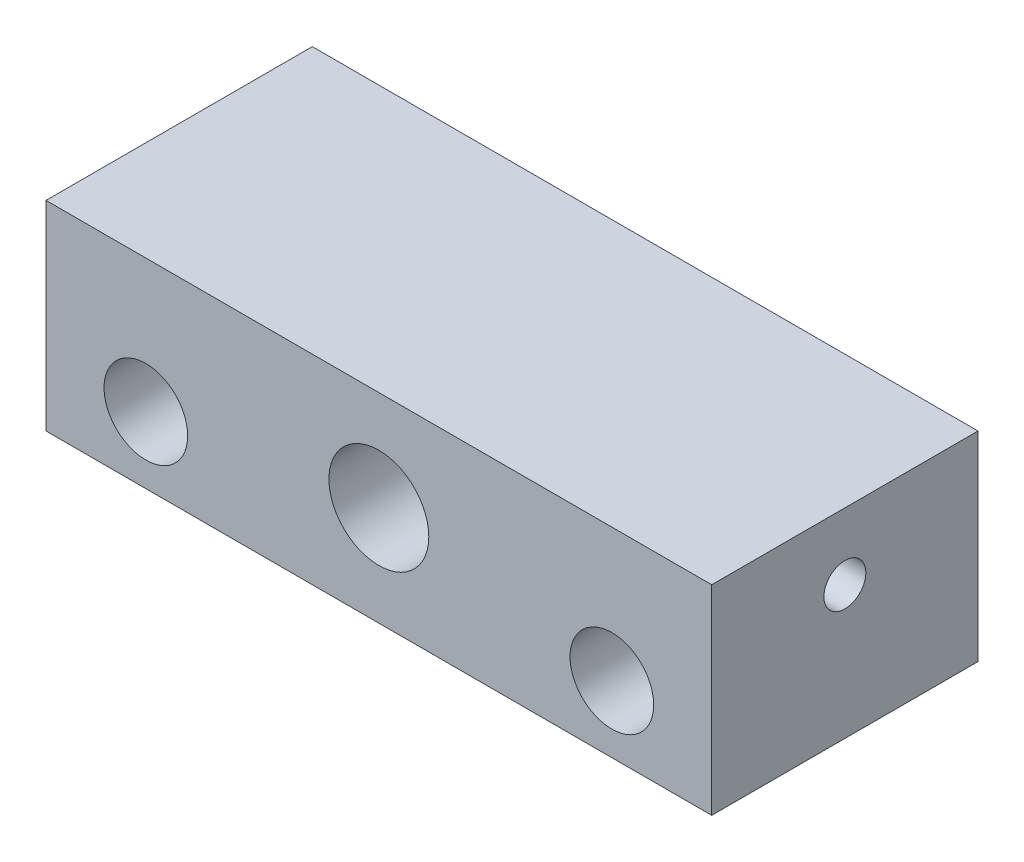
ISO-10303-21;
HEADER;
FILE_DESCRIPTION(('STEP AP214'),'2;1');
FILE_NAME('part.step','',(''),(''),'','','');
FILE_SCHEMA(('AUTOMOTIVE_DESIGN { 1 0 10303 214 1 1 1 1 }'));
ENDSEC;
DATA;
#1=APPLICATION_CONTEXT('core data for automotive mechanical design processes');
#2=APPLICATION_PROTOCOL_DEFINITION('international standard','automotive_design',2000,#1);
#3=PRODUCT_CONTEXT('',#1,'mechanical');
#4=PRODUCT('Part','Part','',(#3));
#5=PRODUCT_RELATED_PRODUCT_CATEGORY('part','',(#4));
#6=PRODUCT_DEFINITION_FORMATION('','',#4);
#7=PRODUCT_DEFINITION_CONTEXT('part definition',#1,'design');
#8=PRODUCT_DEFINITION('design','',#6,#7);
#9=PRODUCT_DEFINITION_SHAPE('','',#8);
#10=(LENGTH_UNIT() NAMED_UNIT(*) SI_UNIT(.MILLI.,.METRE.));
#11=(NAMED_UNIT(*) PLANE_ANGLE_UNIT() SI_UNIT($,.RADIAN.));
#12=(NAMED_UNIT(*) SI_UNIT($,.STERADIAN.) SOLID_ANGLE_UNIT());
#13=UNCERTAINTY_MEASURE_WITH_UNIT(LENGTH_MEASURE(1.E-05),#10,'distance_accuracy_value','');
#14=(GEOMETRIC_REPRESENTATION_CONTEXT(3) GLOBAL_UNCERTAINTY_ASSIGNED_CONTEXT((#13)) GLOBAL_UNIT_ASSIGNED_CONTEXT((#10,
#11,#12)) REPRESENTATION_CONTEXT('',''));
#15=CARTESIAN_POINT('',(0.,0.,0.));
#16=DIRECTION('',(0.,0.,1.));
#17=DIRECTION('',(1.,0.,0.));
#18=AXIS2_PLACEMENT_3D('',#15,#16,#17);
#19=CARTESIAN_POINT('',(31.75,9.525,-25.4));
#20=DIRECTION('',(1.,0.,0.));
#21=DIRECTION('',(0.,1.,0.));
#22=AXIS2_PLACEMENT_3D('',#19,#20,#21);
#23=PLANE('',#22);
#24=CARTESIAN_POINT('',(31.75,3.17500000000001,-12.7));
#25=DIRECTION('',(-1.,0.,0.));
#26=DIRECTION('',(0.,0.,1.));
#27=AXIS2_PLACEMENT_3D('',#24,#25,#26);
#28=CIRCLE('',#27,2.);
#29=CARTESIAN_POINT('',(31.75,3.17500000000001,-10.7));
#30=VERTEX_POINT('',#29);
#31=EDGE_CURVE('E169',#30,#30,#28,.T.);
#32=ORIENTED_EDGE('',*,*,#31,.T.);
#33=EDGE_LOOP('',(#32));
#34=FACE_BOUND('',#33,.T.);
#35=DIRECTION('',(0.,1.,0.));
#36=VECTOR('',#35,1.);
#37=CARTESIAN_POINT('',(31.75,9.525,0.));
#38=LINE('',#37,#36);
#39=CARTESIAN_POINT('',(31.75,-9.525,0.));
#40=VERTEX_POINT('',#39);
#41=CARTESIAN_POINT('',(31.75,9.525,0.));
#42=VERTEX_POINT('',#41);
#43=EDGE_CURVE('E101',#40,#42,#38,.T.);
#44=ORIENTED_EDGE('',*,*,#43,.F.);
#45=DIRECTION('',(0.,0.,1.));
#46=VECTOR('',#45,1.);
#47=CARTESIAN_POINT('',(31.75,-9.525,-25.4));
#48=LINE('',#47,#46);
#49=CARTESIAN_POINT('',(31.75,-9.525,-25.4));
#50=VERTEX_POINT('',#49);
#51=EDGE_CURVE('E11',#50,#40,#48,.T.);
#52=ORIENTED_EDGE('',*,*,#51,.F.);
#53=DIRECTION('',(0.,1.,0.));
#54=VECTOR('',#53,1.);
#55=CARTESIAN_POINT('',(31.75,9.525,-25.4));
#56=LINE('',#55,#54);
#57=CARTESIAN_POINT('',(31.75,9.525,-25.4));
#58=VERTEX_POINT('',#57);
#59=EDGE_CURVE('E94',#50,#58,#56,.T.);
#60=ORIENTED_EDGE('',*,*,#59,.T.);
#61=DIRECTION('',(0.,0.,1.));
#62=VECTOR('',#61,1.);
#63=CARTESIAN_POINT('',(31.75,9.525,-25.4));
#64=LINE('',#63,#62);
#65=EDGE_CURVE('E39',#58,#42,#64,.T.);
#66=ORIENTED_EDGE('',*,*,#65,.T.);
#67=EDGE_LOOP('',(#44,#52,#60,#66));
#68=FACE_BOUND('',#67,.T.);
#69=ADVANCED_FACE('F36',(#34,#68),#23,.T.);
#70=CARTESIAN_POINT('',(-31.75,-9.52500000000001,-25.4));
#71=DIRECTION('',(0.,-1.,0.));
#72=DIRECTION('',(1.,0.,0.));
#73=AXIS2_PLACEMENT_3D('',#70,#71,#72);
#74=PLANE('',#73);
#75=DIRECTION('',(1.,0.,0.));
#76=VECTOR('',#75,1.);
#77=CARTESIAN_POINT('',(-31.75,-9.52500000000001,0.));
#78=LINE('',#77,#76);
#79=CARTESIAN_POINT('',(-31.75,-9.52500000000001,0.));
#80=VERTEX_POINT('',#79);
#81=EDGE_CURVE('E96',#80,#40,#78,.T.);
#82=ORIENTED_EDGE('',*,*,#81,.F.);
#83=DIRECTION('',(0.,0.,1.));
#84=VECTOR('',#83,1.);
#85=CARTESIAN_POINT('',(-31.75,-9.52500000000001,-25.4));
#86=LINE('',#85,#84);
#87=CARTESIAN_POINT('',(-31.75,-9.52500000000001,-25.4));
#88=VERTEX_POINT('',#87);
#89=EDGE_CURVE('E45',#88,#80,#86,.T.);
#90=ORIENTED_EDGE('',*,*,#89,.F.);
#91=DIRECTION('',(1.,0.,0.));
#92=VECTOR('',#91,1.);
#93=CARTESIAN_POINT('',(-31.75,-9.52500000000001,-25.4));
#94=LINE('',#93,#92);
#95=EDGE_CURVE('E91',#88,#50,#94,.T.);
#96=ORIENTED_EDGE('',*,*,#95,.T.);
#97=ORIENTED_EDGE('',*,*,#51,.T.);
#98=EDGE_LOOP('',(#82,#90,#96,#97));
#99=FACE_BOUND('',#98,.T.);
#100=ADVANCED_FACE('F112',(#99),#74,.T.);
#101=CARTESIAN_POINT('',(-31.75,9.52499999999999,-25.4));
#102=DIRECTION('',(-1.,0.,0.));
#103=DIRECTION('',(0.,-1.,0.));
#104=AXIS2_PLACEMENT_3D('',#101,#102,#103);
#105=PLANE('',#104);
#106=CARTESIAN_POINT('',(-31.75,3.175,-12.7));
#107=DIRECTION('',(-1.,0.,0.));
#108=DIRECTION('',(0.,0.,1.));
#109=AXIS2_PLACEMENT_3D('',#106,#107,#108);
#110=CIRCLE('',#109,2.);
#111=CARTESIAN_POINT('',(-31.75,3.175,-10.7));
#112=VERTEX_POINT('',#111);
#113=EDGE_CURVE('E168',#112,#112,#110,.T.);
#114=ORIENTED_EDGE('',*,*,#113,.F.);
#115=EDGE_LOOP('',(#114));
#116=FACE_BOUND('',#115,.T.);
#117=DIRECTION('',(0.,-1.,0.));
#118=VECTOR('',#117,1.);
#119=CARTESIAN_POINT('',(-31.75,9.52499999999999,0.));
#120=LINE('',#119,#118);
#121=CARTESIAN_POINT('',(-31.75,9.52499999999999,0.));
#122=VERTEX_POINT('',#121);
#123=EDGE_CURVE('E86',#122,#80,#120,.T.);
#124=ORIENTED_EDGE('',*,*,#123,.F.);
#125=DIRECTION('',(0.,0.,1.));
#126=VECTOR('',#125,1.);
#127=CARTESIAN_POINT('',(-31.75,9.52499999999999,-25.4));
#128=LINE('',#127,#126);
#129=CARTESIAN_POINT('',(-31.75,9.52499999999999,-25.4));
#130=VERTEX_POINT('',#129);
#131=EDGE_CURVE('E81',#130,#122,#128,.T.);
#132=ORIENTED_EDGE('',*,*,#131,.F.);
#133=DIRECTION('',(0.,-1.,0.));
#134=VECTOR('',#133,1.);
#135=CARTESIAN_POINT('',(-31.75,9.52499999999999,-25.4));
#136=LINE('',#135,#134);
#137=EDGE_CURVE('E84',#130,#88,#136,.T.);
#138=ORIENTED_EDGE('',*,*,#137,.T.);
#139=ORIENTED_EDGE('',*,*,#89,.T.);
#140=EDGE_LOOP('',(#124,#132,#138,#139));
#141=FACE_BOUND('',#140,.T.);
#142=ADVANCED_FACE('F83',(#116,#141),#105,.T.);
#143=CARTESIAN_POINT('',(-31.75,9.52499999999999,-25.4));
#144=DIRECTION('',(0.,1.,0.));
#145=DIRECTION('',(-1.,0.,0.));
#146=AXIS2_PLACEMENT_3D('',#143,#144,#145);
#147=PLANE('',#146);
#148=DIRECTION('',(-1.,0.,0.));
#149=VECTOR('',#148,1.);
#150=CARTESIAN_POINT('',(-31.75,9.52499999999999,0.));
#151=LINE('',#150,#149);
#152=EDGE_CURVE('E104',#42,#122,#151,.T.);
#153=ORIENTED_EDGE('',*,*,#152,.F.);
#154=ORIENTED_EDGE('',*,*,#65,.F.);
#155=DIRECTION('',(-1.,0.,0.));
#156=VECTOR('',#155,1.);
#157=CARTESIAN_POINT('',(-31.75,9.52499999999999,-25.4));
#158=LINE('',#157,#156);
#159=EDGE_CURVE('E90',#58,#130,#158,.T.);
#160=ORIENTED_EDGE('',*,*,#159,.T.);
#161=ORIENTED_EDGE('',*,*,#131,.T.);
#162=EDGE_LOOP('',(#153,#154,#160,#161));
#163=FACE_BOUND('',#162,.T.);
#164=ADVANCED_FACE('F93',(#163),#147,.T.);
#165=CARTESIAN_POINT('',(0.,0.,-25.4));
#166=DIRECTION('',(0.,0.,1.));
#167=DIRECTION('',(1.,0.,0.));
#168=AXIS2_PLACEMENT_3D('',#165,#166,#167);
#169=PLANE('',#168);
#170=CARTESIAN_POINT('',(22.225,-3.17500000000001,-25.4));
#171=DIRECTION('',(0.,0.,1.));
#172=DIRECTION('',(1.,0.,0.));
#173=AXIS2_PLACEMENT_3D('',#170,#171,#172);
#174=CIRCLE('',#173,3.98780000000001);
#175=CARTESIAN_POINT('',(26.2128,-3.17500000000001,-25.4));
#176=VERTEX_POINT('',#175);
#177=EDGE_CURVE('E180',#176,#176,#174,.T.);
#178=ORIENTED_EDGE('',*,*,#177,.T.);
#179=EDGE_LOOP('',(#178));
#180=FACE_BOUND('',#179,.T.);
#181=CARTESIAN_POINT('',(-22.225,-3.17500000000001,-25.4));
#182=DIRECTION('',(0.,0.,1.));
#183=DIRECTION('',(1.,0.,0.));
#184=AXIS2_PLACEMENT_3D('',#181,#182,#183);
#185=CIRCLE('',#184,3.9878);
#186=CARTESIAN_POINT('',(-18.2372,-3.17500000000001,-25.4));
#187=VERTEX_POINT('',#186);
#188=EDGE_CURVE('E185',#187,#187,#185,.T.);
#189=ORIENTED_EDGE('',*,*,#188,.T.);
#190=EDGE_LOOP('',(#189));
#191=FACE_BOUND('',#190,.T.);
#192=CARTESIAN_POINT('',(0.,0.,-25.4));
#193=DIRECTION('',(0.,0.,1.));
#194=DIRECTION('',(1.,0.,0.));
#195=AXIS2_PLACEMENT_3D('',#192,#193,#194);
#196=CIRCLE('',#195,4.7625);
#197=CARTESIAN_POINT('',(4.76249999999999,0.,-25.4));
#198=VERTEX_POINT('',#197);
#199=EDGE_CURVE('E105',#198,#198,#196,.T.);
#200=ORIENTED_EDGE('',*,*,#199,.T.);
#201=EDGE_LOOP('',(#200));
#202=FACE_BOUND('',#201,.T.);
#203=ORIENTED_EDGE('',*,*,#59,.F.);
#204=ORIENTED_EDGE('',*,*,#95,.F.);
#205=ORIENTED_EDGE('',*,*,#137,.F.);
#206=ORIENTED_EDGE('',*,*,#159,.F.);
#207=EDGE_LOOP('',(#203,#204,#205,#206));
#208=FACE_BOUND('',#207,.T.);
#209=ADVANCED_FACE('F89',(#180,#191,#202,#208),#169,.F.);
#210=CARTESIAN_POINT('',(0.,0.,0.));
#211=DIRECTION('',(0.,0.,1.));
#212=DIRECTION('',(1.,0.,0.));
#213=AXIS2_PLACEMENT_3D('',#210,#211,#212);
#214=PLANE('',#213);
#215=CARTESIAN_POINT('',(22.225,-3.17500000000001,0.));
#216=DIRECTION('',(0.,0.,1.));
#217=DIRECTION('',(1.,0.,0.));
#218=AXIS2_PLACEMENT_3D('',#215,#216,#217);
#219=CIRCLE('',#218,3.98780000000001);
#220=CARTESIAN_POINT('',(26.2128,-3.17500000000001,0.));
#221=VERTEX_POINT('',#220);
#222=EDGE_CURVE('E178',#221,#221,#219,.T.);
#223=ORIENTED_EDGE('',*,*,#222,.F.);
#224=EDGE_LOOP('',(#223));
#225=FACE_BOUND('',#224,.T.);
#226=CARTESIAN_POINT('',(-22.225,-3.17500000000001,0.));
#227=DIRECTION('',(0.,0.,1.));
#228=DIRECTION('',(1.,0.,0.));
#229=AXIS2_PLACEMENT_3D('',#226,#227,#228);
#230=CIRCLE('',#229,3.9878);
#231=CARTESIAN_POINT('',(-18.2372,-3.17500000000001,0.));
#232=VERTEX_POINT('',#231);
#233=EDGE_CURVE('E182',#232,#232,#230,.T.);
#234=ORIENTED_EDGE('',*,*,#233,.F.);
#235=EDGE_LOOP('',(#234));
#236=FACE_BOUND('',#235,.T.);
#237=CARTESIAN_POINT('',(0.,0.,0.));
#238=DIRECTION('',(0.,0.,1.));
#239=DIRECTION('',(1.,0.,0.));
#240=AXIS2_PLACEMENT_3D('',#237,#238,#239);
#241=CIRCLE('',#240,4.7625);
#242=CARTESIAN_POINT('',(4.76249999999999,0.,0.));
#243=VERTEX_POINT('',#242);
#244=EDGE_CURVE('E188',#243,#243,#241,.T.);
#245=ORIENTED_EDGE('',*,*,#244,.F.);
#246=EDGE_LOOP('',(#245));
#247=FACE_BOUND('',#246,.T.);
#248=ORIENTED_EDGE('',*,*,#43,.T.);
#249=ORIENTED_EDGE('',*,*,#152,.T.);
#250=ORIENTED_EDGE('',*,*,#123,.T.);
#251=ORIENTED_EDGE('',*,*,#81,.T.);
#252=EDGE_LOOP('',(#248,#249,#250,#251));
#253=FACE_BOUND('',#252,.T.);
#254=ADVANCED_FACE('F111',(#225,#236,#247,#253),#214,.T.);
#255=CARTESIAN_POINT('',(0.,0.,-25.4));
#256=DIRECTION('',(0.,0.,1.));
#257=DIRECTION('',(1.,0.,0.));
#258=AXIS2_PLACEMENT_3D('',#255,#256,#257);
#259=CYLINDRICAL_SURFACE('',#258,4.7625);
#260=ORIENTED_EDGE('',*,*,#199,.F.);
#261=EDGE_LOOP('',(#260));
#262=FACE_BOUND('',#261,.T.);
#263=ORIENTED_EDGE('',*,*,#244,.T.);
#264=EDGE_LOOP('',(#263));
#265=FACE_BOUND('',#264,.T.);
#266=ADVANCED_FACE('F132',(#262,#265),#259,.F.);
#267=CARTESIAN_POINT('',(-22.225,-3.17500000000001,-25.4));
#268=DIRECTION('',(0.,0.,1.));
#269=DIRECTION('',(1.,0.,0.));
#270=AXIS2_PLACEMENT_3D('',#267,#268,#269);
#271=CYLINDRICAL_SURFACE('',#270,3.9878);
#272=ORIENTED_EDGE('',*,*,#188,.F.);
#273=EDGE_LOOP('',(#272));
#274=FACE_BOUND('',#273,.T.);
#275=ORIENTED_EDGE('',*,*,#233,.T.);
#276=EDGE_LOOP('',(#275));
#277=FACE_BOUND('',#276,.T.);
#278=ADVANCED_FACE('F139',(#274,#277),#271,.F.);
#279=CARTESIAN_POINT('',(22.225,-3.17500000000001,-25.4));
#280=DIRECTION('',(0.,0.,1.));
#281=DIRECTION('',(1.,0.,0.));
#282=AXIS2_PLACEMENT_3D('',#279,#280,#281);
#283=CYLINDRICAL_SURFACE('',#282,3.98780000000001);
#284=ORIENTED_EDGE('',*,*,#177,.F.);
#285=EDGE_LOOP('',(#284));
#286=FACE_BOUND('',#285,.T.);
#287=ORIENTED_EDGE('',*,*,#222,.T.);
#288=EDGE_LOOP('',(#287));
#289=FACE_BOUND('',#288,.T.);
#290=ADVANCED_FACE('F143',(#286,#289),#283,.F.);
#291=CARTESIAN_POINT('',(-25.4,3.175,-12.7));
#292=DIRECTION('',(-1.,0.,0.));
#293=DIRECTION('',(0.,0.,1.));
#294=AXIS2_PLACEMENT_3D('',#291,#292,#293);
#295=CYLINDRICAL_SURFACE('',#294,2.);
#296=CARTESIAN_POINT('',(-25.4,3.175,-12.7));
#297=DIRECTION('',(-1.,0.,0.));
#298=DIRECTION('',(0.,0.,1.));
#299=AXIS2_PLACEMENT_3D('',#296,#297,#298);
#300=CIRCLE('',#299,2.);
#301=CARTESIAN_POINT('',(-25.4,3.175,-10.7));
#302=VERTEX_POINT('',#301);
#303=EDGE_CURVE('E172',#302,#302,#300,.T.);
#304=ORIENTED_EDGE('',*,*,#303,.F.);
#305=EDGE_LOOP('',(#304));
#306=FACE_BOUND('',#305,.T.);
#307=ORIENTED_EDGE('',*,*,#113,.T.);
#308=EDGE_LOOP('',(#307));
#309=FACE_BOUND('',#308,.T.);
#310=ADVANCED_FACE('F147',(#306,#309),#295,.F.);
#311=CARTESIAN_POINT('',(-25.4,3.175,-12.7));
#312=DIRECTION('',(-1.,0.,0.));
#313=DIRECTION('',(0.,0.,1.));
#314=AXIS2_PLACEMENT_3D('',#311,#312,#313);
#315=PLANE('',#314);
#316=ORIENTED_EDGE('',*,*,#303,.T.);
#317=EDGE_LOOP('',(#316));
#318=FACE_BOUND('',#317,.T.);
#319=ADVANCED_FACE('F151',(#318),#315,.T.);
#320=CARTESIAN_POINT('',(25.4,3.17500000000001,-12.7));
#321=DIRECTION('',(1.,0.,0.));
#322=DIRECTION('',(0.,1.,0.));
#323=AXIS2_PLACEMENT_3D('',#320,#321,#322);
#324=CYLINDRICAL_SURFACE('',#323,2.);
#325=CARTESIAN_POINT('',(25.4,3.17500000000001,-12.7));
#326=DIRECTION('',(-1.,0.,0.));
#327=DIRECTION('',(0.,0.,1.));
#328=AXIS2_PLACEMENT_3D('',#325,#326,#327);
#329=CIRCLE('',#328,2.);
#330=CARTESIAN_POINT('',(25.4,3.17500000000001,-10.7));
#331=VERTEX_POINT('',#330);
#332=EDGE_CURVE('E167',#331,#331,#329,.T.);
#333=ORIENTED_EDGE('',*,*,#332,.T.);
#334=EDGE_LOOP('',(#333));
#335=FACE_BOUND('',#334,.T.);
#336=ORIENTED_EDGE('',*,*,#31,.F.);
#337=EDGE_LOOP('',(#336));
#338=FACE_BOUND('',#337,.T.);
#339=ADVANCED_FACE('F155',(#335,#338),#324,.F.);
#340=CARTESIAN_POINT('',(25.4,3.17500000000001,-12.7));
#341=DIRECTION('',(1.,0.,0.));
#342=DIRECTION('',(0.,0.,1.));
#343=AXIS2_PLACEMENT_3D('',#340,#341,#342);
#344=PLANE('',#343);
#345=ORIENTED_EDGE('',*,*,#332,.F.);
#346=EDGE_LOOP('',(#345));
#347=FACE_BOUND('',#346,.T.);
#348=ADVANCED_FACE('F159',(#347),#344,.T.);
#349=CLOSED_SHELL('',(#69,#100,#142,#164,#209,#254,#266,#278,#290,#310,#319,#339,#348));
#350=MANIFOLD_SOLID_BREP('B2',#349);
#351=ADVANCED_BREP_SHAPE_REPRESENTATION('',(#18,#350),#14);
#352=SHAPE_DEFINITION_REPRESENTATION(#9,#351);
ENDSEC;
END-ISO-10303-21;
